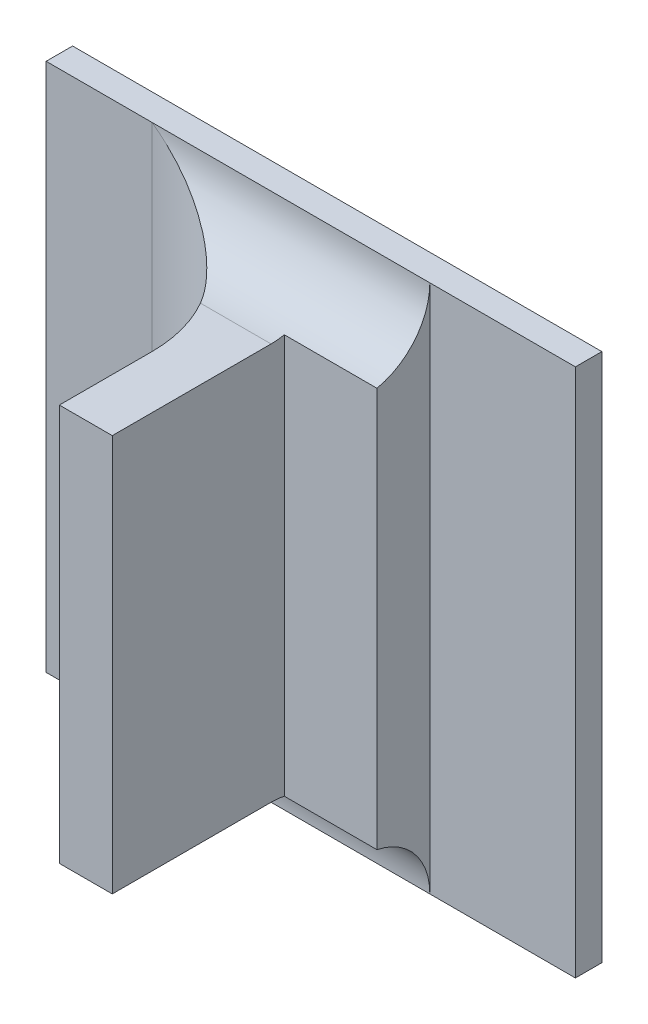
ISO-10303-21;
HEADER;
FILE_DESCRIPTION(('STEP AP214'),'2;1');
FILE_NAME('part.step','',(''),(''),'','','');
FILE_SCHEMA(('AUTOMOTIVE_DESIGN { 1 0 10303 214 1 1 1 1 }'));
ENDSEC;
DATA;
#1=APPLICATION_CONTEXT('core data for automotive mechanical design processes');
#2=APPLICATION_PROTOCOL_DEFINITION('international standard','automotive_design',2000,#1);
#3=PRODUCT_CONTEXT('',#1,'mechanical');
#4=PRODUCT('Part','Part','',(#3));
#5=PRODUCT_RELATED_PRODUCT_CATEGORY('part','',(#4));
#6=PRODUCT_DEFINITION_FORMATION('','',#4);
#7=PRODUCT_DEFINITION_CONTEXT('part definition',#1,'design');
#8=PRODUCT_DEFINITION('design','',#6,#7);
#9=PRODUCT_DEFINITION_SHAPE('','',#8);
#10=(LENGTH_UNIT() NAMED_UNIT(*) SI_UNIT(.MILLI.,.METRE.));
#11=(NAMED_UNIT(*) PLANE_ANGLE_UNIT() SI_UNIT($,.RADIAN.));
#12=(NAMED_UNIT(*) SI_UNIT($,.STERADIAN.) SOLID_ANGLE_UNIT());
#13=UNCERTAINTY_MEASURE_WITH_UNIT(LENGTH_MEASURE(1.E-05),#10,'distance_accuracy_value','');
#14=(GEOMETRIC_REPRESENTATION_CONTEXT(3) GLOBAL_UNCERTAINTY_ASSIGNED_CONTEXT((#13)) GLOBAL_UNIT_ASSIGNED_CONTEXT((#10,
#11,#12)) REPRESENTATION_CONTEXT('',''));
#15=CARTESIAN_POINT('',(0.,0.,0.));
#16=DIRECTION('',(0.,0.,1.));
#17=DIRECTION('',(1.,0.,0.));
#18=AXIS2_PLACEMENT_3D('',#15,#16,#17);
#19=CARTESIAN_POINT('',(0.284904218627624,-0.311549667580545,0.0888870078740156));
#20=DIRECTION('',(0.,0.,1.));
#21=DIRECTION('',(1.,0.,0.));
#22=AXIS2_PLACEMENT_3D('',#19,#20,#21);
#23=PLANE('',#22);
#24=DIRECTION('',(1.,0.,0.));
#25=VECTOR('',#24,1.);
#26=CARTESIAN_POINT('',(0.277588649165875,-0.351234706950624,0.0888870078740156));
#27=LINE('',#26,#25);
#28=CARTESIAN_POINT('',(0.284652250123687,-0.351234706950624,0.0888870078740156));
#29=VERTEX_POINT('',#28);
#30=CARTESIAN_POINT('',(0.279612880044947,-0.351234706950624,0.0888870078740156));
#31=VERTEX_POINT('',#30);
#32=EDGE_CURVE('E193',#29,#31,#27,.F.);
#33=ORIENTED_EDGE('',*,*,#32,.F.);
#34=DIRECTION('',(0.,1.,0.));
#35=VECTOR('',#34,1.);
#36=CARTESIAN_POINT('',(0.284652250123687,-0.35326446766354,0.0888870078740156));
#37=LINE('',#36,#35);
#38=CARTESIAN_POINT('',(0.284652250123687,-0.313439431360073,0.0888870078740156));
#39=VERTEX_POINT('',#38);
#40=EDGE_CURVE('E187',#39,#29,#37,.F.);
#41=ORIENTED_EDGE('',*,*,#40,.F.);
#42=DIRECTION('',(1.,0.,0.));
#43=VECTOR('',#42,1.);
#44=CARTESIAN_POINT('',(0.277588649165875,-0.313439431360073,0.0888870078740156));
#45=LINE('',#44,#43);
#46=CARTESIAN_POINT('',(0.279612880044947,-0.313439431360073,0.0888870078740156));
#47=VERTEX_POINT('',#46);
#48=EDGE_CURVE('E180',#39,#47,#45,.F.);
#49=ORIENTED_EDGE('',*,*,#48,.T.);
#50=DIRECTION('',(0.,-1.,0.));
#51=VECTOR('',#50,1.);
#52=CARTESIAN_POINT('',(0.279612880044947,-0.311549667580545,0.0888870078740156));
#53=LINE('',#52,#51);
#54=EDGE_CURVE('E177',#31,#47,#53,.F.);
#55=ORIENTED_EDGE('',*,*,#54,.F.);
#56=EDGE_LOOP('',(#33,#41,#49,#55));
#57=FACE_BOUND('',#56,.T.);
#58=ADVANCED_FACE('F17',(#57),#23,.T.);
#59=CARTESIAN_POINT('',(0.279612880044947,-0.311549667580545,0.0796271653543306));
#60=DIRECTION('',(-1.,0.,0.));
#61=DIRECTION('',(0.,-1.,0.));
#62=AXIS2_PLACEMENT_3D('',#59,#60,#61);
#63=PLANE('',#62);
#64=DIRECTION('',(0.,0.,1.));
#65=VECTOR('',#64,1.);
#66=CARTESIAN_POINT('',(0.279612880044947,-0.313439431360073,0.0730129921259841));
#67=LINE('',#66,#65);
#68=CARTESIAN_POINT('',(0.279612880044947,-0.313439431360073,0.0800681102362204));
#69=VERTEX_POINT('',#68);
#70=EDGE_CURVE('E184',#47,#69,#67,.F.);
#71=ORIENTED_EDGE('',*,*,#70,.T.);
#72=DIRECTION('',(0.,1.,0.));
#73=VECTOR('',#72,1.);
#74=CARTESIAN_POINT('',(0.279612880044947,-0.360053604588419,0.0800681102362204));
#75=LINE('',#74,#73);
#76=CARTESIAN_POINT('',(0.279612880044947,-0.351234706950624,0.0800681102362204));
#77=VERTEX_POINT('',#76);
#78=EDGE_CURVE('E127',#69,#77,#75,.F.);
#79=ORIENTED_EDGE('',*,*,#78,.T.);
#80=DIRECTION('',(0.,0.,1.));
#81=VECTOR('',#80,1.);
#82=CARTESIAN_POINT('',(0.279612880044947,-0.351234706950624,0.0730129921259841));
#83=LINE('',#82,#81);
#84=EDGE_CURVE('E196',#31,#77,#83,.F.);
#85=ORIENTED_EDGE('',*,*,#84,.F.);
#86=ORIENTED_EDGE('',*,*,#54,.T.);
#87=EDGE_LOOP('',(#71,#79,#85,#86));
#88=FACE_BOUND('',#87,.T.);
#89=ADVANCED_FACE('F242',(#88),#63,.T.);
#90=CARTESIAN_POINT('',(0.277588649165875,-0.313439431360073,0.0730129921259841));
#91=DIRECTION('',(0.,-1.,0.));
#92=DIRECTION('',(1.,0.,0.));
#93=AXIS2_PLACEMENT_3D('',#90,#91,#92);
#94=PLANE('',#93);
#95=ORIENTED_EDGE('',*,*,#70,.F.);
#96=ORIENTED_EDGE('',*,*,#48,.F.);
#97=DIRECTION('',(0.,0.,1.));
#98=VECTOR('',#97,1.);
#99=CARTESIAN_POINT('',(0.284652250123687,-0.313439431360073,0.0716901574803148));
#100=LINE('',#99,#98);
#101=CARTESIAN_POINT('',(0.284652250123687,-0.313439431360073,0.0737688976377952));
#102=VERTEX_POINT('',#101);
#103=EDGE_CURVE('E115',#102,#39,#100,.T.);
#104=ORIENTED_EDGE('',*,*,#103,.F.);
#105=DIRECTION('',(1.,0.,0.));
#106=VECTOR('',#105,1.);
#107=CARTESIAN_POINT('',(0.265691620202427,-0.313439431360073,0.0737688976377952));
#108=LINE('',#107,#106);
#109=CARTESIAN_POINT('',(0.277925011116247,-0.313439431360073,0.0737688976377952));
#110=VERTEX_POINT('',#109);
#111=EDGE_CURVE('E109',#102,#110,#108,.F.);
#112=ORIENTED_EDGE('',*,*,#111,.T.);
#113=CARTESIAN_POINT('',(0.267014454848097,-0.313439431360073,0.0800681102362204));
#114=DIRECTION('',(0.,1.,0.));
#115=DIRECTION('',(-1.,0.,0.));
#116=AXIS2_PLACEMENT_3D('',#113,#114,#115);
#117=CIRCLE('',#116,0.0125984251968504);
#118=EDGE_CURVE('E20',#110,#69,#117,.F.);
#119=ORIENTED_EDGE('',*,*,#118,.T.);
#120=EDGE_LOOP('',(#95,#96,#104,#112,#119));
#121=FACE_BOUND('',#120,.T.);
#122=ADVANCED_FACE('F112',(#121),#94,.F.);
#123=CARTESIAN_POINT('',(0.277588649165875,-0.351234706950624,0.0730129921259841));
#124=DIRECTION('',(0.,-1.,0.));
#125=DIRECTION('',(1.,0.,0.));
#126=AXIS2_PLACEMENT_3D('',#123,#124,#125);
#127=PLANE('',#126);
#128=CARTESIAN_POINT('',(0.267014454848097,-0.351234706950624,0.0800681102362204));
#129=DIRECTION('',(0.,1.,0.));
#130=DIRECTION('',(-1.,0.,0.));
#131=AXIS2_PLACEMENT_3D('',#128,#129,#130);
#132=CIRCLE('',#131,0.0125984251968504);
#133=CARTESIAN_POINT('',(0.277925011116247,-0.351234706950624,0.0737688976377951));
#134=VERTEX_POINT('',#133);
#135=EDGE_CURVE('E121',#77,#134,#132,.T.);
#136=ORIENTED_EDGE('',*,*,#135,.T.);
#137=DIRECTION('',(-1.,0.,0.));
#138=VECTOR('',#137,1.);
#139=CARTESIAN_POINT('',(0.319927840674868,-0.351234706950624,0.0737688976377952));
#140=LINE('',#139,#138);
#141=CARTESIAN_POINT('',(0.284652250123687,-0.351234706950624,0.0737688976377952));
#142=VERTEX_POINT('',#141);
#143=EDGE_CURVE('E169',#134,#142,#140,.F.);
#144=ORIENTED_EDGE('',*,*,#143,.T.);
#145=DIRECTION('',(0.,0.,1.));
#146=VECTOR('',#145,1.);
#147=CARTESIAN_POINT('',(0.284652250123687,-0.351234706950624,0.0716901574803148));
#148=LINE('',#147,#146);
#149=EDGE_CURVE('E190',#29,#142,#148,.F.);
#150=ORIENTED_EDGE('',*,*,#149,.F.);
#151=ORIENTED_EDGE('',*,*,#32,.T.);
#152=ORIENTED_EDGE('',*,*,#84,.T.);
#153=EDGE_LOOP('',(#136,#144,#150,#151,#152));
#154=FACE_BOUND('',#153,.T.);
#155=ADVANCED_FACE('F235',(#154),#127,.T.);
#156=CARTESIAN_POINT('',(0.284652250123687,-0.35326446766354,0.0716901574803148));
#157=DIRECTION('',(1.,0.,0.));
#158=DIRECTION('',(0.,1.,0.));
#159=AXIS2_PLACEMENT_3D('',#156,#157,#158);
#160=PLANE('',#159);
#161=DIRECTION('',(0.,1.,0.));
#162=VECTOR('',#161,1.);
#163=CARTESIAN_POINT('',(0.284652250123687,-0.311409670647157,0.0725090551181101));
#164=LINE('',#163,#162);
#165=CARTESIAN_POINT('',(0.284652250123687,-0.313312161420629,0.0725090551181101));
#166=VERTEX_POINT('',#165);
#167=CARTESIAN_POINT('',(0.284652250123687,-0.351361976890068,0.0725090551181101));
#168=VERTEX_POINT('',#167);
#169=EDGE_CURVE('E216',#166,#168,#164,.F.);
#170=ORIENTED_EDGE('',*,*,#169,.F.);
#171=CARTESIAN_POINT('',(0.284652250123687,-0.313312161420629,0.0725090551181101));
#172=CARTESIAN_POINT('',(0.284652250123687,-0.313439431360073,0.0731325479405746));
#173=CARTESIAN_POINT('',(0.284652250123687,-0.313439431360073,0.0737688976377952));
#174=B_SPLINE_CURVE_WITH_KNOTS('',2,(#171,#172,#173),.UNSPECIFIED.,.F.,.F.,(3,3),(0.,1.),.UNSPECIFIED.);
#175=EDGE_CURVE('E217',#166,#102,#174,.T.);
#176=ORIENTED_EDGE('',*,*,#175,.T.);
#177=ORIENTED_EDGE('',*,*,#103,.T.);
#178=ORIENTED_EDGE('',*,*,#40,.T.);
#179=ORIENTED_EDGE('',*,*,#149,.T.);
#180=CARTESIAN_POINT('',(0.284652250123687,-0.351234706950624,0.0737688976377952));
#181=CARTESIAN_POINT('',(0.284652250123687,-0.351234706950624,0.0731325479405747));
#182=CARTESIAN_POINT('',(0.284652250123687,-0.351361976890068,0.0725090551181101));
#183=B_SPLINE_CURVE_WITH_KNOTS('',2,(#180,#181,#182),.UNSPECIFIED.,.F.,.F.,(3,3),(0.,1.),.UNSPECIFIED.);
#184=EDGE_CURVE('E221',#142,#168,#183,.T.);
#185=ORIENTED_EDGE('',*,*,#184,.T.);
#186=EDGE_LOOP('',(#170,#176,#177,#178,#179,#185));
#187=FACE_BOUND('',#186,.T.);
#188=ADVANCED_FACE('F224',(#187),#160,.T.);
#189=CARTESIAN_POINT('',(0.293912092643372,-0.311409670647157,0.0725090551181101));
#190=DIRECTION('',(0.,0.,1.));
#191=DIRECTION('',(1.,0.,0.));
#192=AXIS2_PLACEMENT_3D('',#189,#190,#191);
#193=PLANE('',#192);
#194=DIRECTION('',(0.,1.,0.));
#195=VECTOR('',#194,1.);
#196=CARTESIAN_POINT('',(0.293471147761482,-0.304620533722278,0.0725090551181101));
#197=LINE('',#196,#195);
#198=CARTESIAN_POINT('',(0.293471147761482,-0.313312161420629,0.0725090551181101));
#199=VERTEX_POINT('',#198);
#200=CARTESIAN_POINT('',(0.293471147761482,-0.351361976890068,0.0725090551181101));
#201=VERTEX_POINT('',#200);
#202=EDGE_CURVE('E128',#199,#201,#197,.F.);
#203=ORIENTED_EDGE('',*,*,#202,.F.);
#204=DIRECTION('',(1.,0.,0.));
#205=VECTOR('',#204,1.);
#206=CARTESIAN_POINT('',(0.265691620202427,-0.313312161420629,0.0725090551181101));
#207=LINE('',#206,#205);
#208=EDGE_CURVE('E139',#199,#166,#207,.F.);
#209=ORIENTED_EDGE('',*,*,#208,.T.);
#210=ORIENTED_EDGE('',*,*,#169,.T.);
#211=DIRECTION('',(-1.,0.,0.));
#212=VECTOR('',#211,1.);
#213=CARTESIAN_POINT('',(0.319927840674868,-0.351361976890068,0.0725090551181101));
#214=LINE('',#213,#212);
#215=EDGE_CURVE('E174',#168,#201,#214,.F.);
#216=ORIENTED_EDGE('',*,*,#215,.T.);
#217=EDGE_LOOP('',(#203,#209,#210,#216));
#218=FACE_BOUND('',#217,.T.);
#219=ADVANCED_FACE('F234',(#218),#193,.T.);
#220=CARTESIAN_POINT('',(0.293471147761482,-0.304620533722278,0.067217716535433));
#221=DIRECTION('',(1.,0.,0.));
#222=DIRECTION('',(0.,1.,0.));
#223=AXIS2_PLACEMENT_3D('',#220,#221,#222);
#224=PLANE('',#223);
#225=DIRECTION('',(0.,1.,0.));
#226=VECTOR('',#225,1.);
#227=CARTESIAN_POINT('',(0.293471147761482,-0.304620533722278,0.06746968503937));
#228=LINE('',#227,#226);
#229=CARTESIAN_POINT('',(0.293471147761482,-0.357533919549049,0.06746968503937));
#230=VERTEX_POINT('',#229);
#231=CARTESIAN_POINT('',(0.293471147761482,-0.307140218761648,0.06746968503937));
#232=VERTEX_POINT('',#231);
#233=EDGE_CURVE('E170',#230,#232,#228,.T.);
#234=ORIENTED_EDGE('',*,*,#233,.T.);
#235=CARTESIAN_POINT('',(0.293471147761482,-0.307140218761648,0.0737688976377952));
#236=DIRECTION('',(1.,0.,0.));
#237=DIRECTION('',(0.,1.,0.));
#238=AXIS2_PLACEMENT_3D('',#235,#236,#237);
#239=CIRCLE('',#238,0.0062992125984252);
#240=EDGE_CURVE('E136',#232,#199,#239,.F.);
#241=ORIENTED_EDGE('',*,*,#240,.T.);
#242=ORIENTED_EDGE('',*,*,#202,.T.);
#243=CARTESIAN_POINT('',(0.293471147761482,-0.357533919549049,0.0737688976377952));
#244=DIRECTION('',(-1.,0.,0.));
#245=DIRECTION('',(0.,-1.,0.));
#246=AXIS2_PLACEMENT_3D('',#243,#244,#245);
#247=CIRCLE('',#246,0.0062992125984252);
#248=EDGE_CURVE('E171',#201,#230,#247,.T.);
#249=ORIENTED_EDGE('',*,*,#248,.T.);
#250=EDGE_LOOP('',(#234,#241,#242,#249));
#251=FACE_BOUND('',#250,.T.);
#252=ADVANCED_FACE('F318',(#251),#224,.T.);
#253=CARTESIAN_POINT('',(0.267014454848097,-0.360053604588419,0.0800681102362204));
#254=DIRECTION('',(0.,1.,0.));
#255=DIRECTION('',(-1.,0.,0.));
#256=AXIS2_PLACEMENT_3D('',#253,#254,#255);
#257=CYLINDRICAL_SURFACE('',#256,0.0125984251968504);
#258=ORIENTED_EDGE('',*,*,#78,.F.);
#259=ORIENTED_EDGE('',*,*,#118,.F.);
#260=CARTESIAN_POINT('',(0.277925011116247,-0.313439431360073,0.073768897637795));
#261=CARTESIAN_POINT('',(0.277652526611768,-0.313438873707853,0.0732955457546591));
#262=CARTESIAN_POINT('',(0.277350414486164,-0.313386346377414,0.0728445682080297));
#263=CARTESIAN_POINT('',(0.276704946712164,-0.313201363699116,0.0720003898002664));
#264=CARTESIAN_POINT('',(0.276362214236907,-0.313070015578846,0.0716064807283955));
#265=CARTESIAN_POINT('',(0.275576977112133,-0.312719656172453,0.0708064921171964));
#266=CARTESIAN_POINT('',(0.27512790598383,-0.312488708936628,0.0704123993317733));
#267=CARTESIAN_POINT('',(0.274197979722231,-0.311970610304802,0.0697017381084181));
#268=CARTESIAN_POINT('',(0.273716946451535,-0.311683122697778,0.0693856602556568));
#269=CARTESIAN_POINT('',(0.272536209007032,-0.310946965938325,0.0687164538298326));
#270=CARTESIAN_POINT('',(0.27182693189567,-0.310480210038906,0.0684002761150404));
#271=CARTESIAN_POINT('',(0.270389904180813,-0.309508649017801,0.0679065689436589));
#272=CARTESIAN_POINT('',(0.269662185421036,-0.309003906866,0.0677288153407497));
#273=CARTESIAN_POINT('',(0.268486222851557,-0.308179722442743,0.0675478835698786));
#274=CARTESIAN_POINT('',(0.268040368067287,-0.307865289365079,0.0675035718032502));
#275=CARTESIAN_POINT('',(0.267400947022718,-0.307413510055304,0.0674741343290926));
#276=CARTESIAN_POINT('',(0.267207696373057,-0.307276860634179,0.0674696949622004));
#277=CARTESIAN_POINT('',(0.267014454848097,-0.307140218761648,0.06746968503937));
#278=B_SPLINE_CURVE_WITH_KNOTS('',3,(#260,#261,#262,#263,#264,#265,#266,#267,#268,#269,#270,
#271,#272,#273,#274,#275,#276,#277),.UNSPECIFIED.,.F.,.F.,(4,2,2,2,2,2,2,2,4),(0.,
0.00162828046163536,0.00323420635682064,0.00514617952943934,0.00706988591555804,
0.00977367423346223,0.012473075225337,0.0141132082090727,0.0148232188039429),.UNSPECIFIED.);
#279=CARTESIAN_POINT('',(0.267014454848097,-0.307140218761648,0.06746968503937));
#280=VERTEX_POINT('',#279);
#281=EDGE_CURVE('E120',#110,#280,#278,.T.);
#282=ORIENTED_EDGE('',*,*,#281,.T.);
#283=DIRECTION('',(0.,1.,0.));
#284=VECTOR('',#283,1.);
#285=CARTESIAN_POINT('',(0.267014454848097,-0.304620533722278,0.06746968503937));
#286=LINE('',#285,#284);
#287=CARTESIAN_POINT('',(0.267014454848097,-0.357533919549049,0.06746968503937));
#288=VERTEX_POINT('',#287);
#289=EDGE_CURVE('E173',#280,#288,#286,.F.);
#290=ORIENTED_EDGE('',*,*,#289,.T.);
#291=CARTESIAN_POINT('',(0.277925011116247,-0.351234706950624,0.073768897637795));
#292=CARTESIAN_POINT('',(0.277652526611768,-0.351235264602844,0.0732955457546591));
#293=CARTESIAN_POINT('',(0.277350414486164,-0.351287791933283,0.0728445682080297));
#294=CARTESIAN_POINT('',(0.276704946712164,-0.351472774611581,0.0720003898002663));
#295=CARTESIAN_POINT('',(0.276362214236907,-0.351604122731851,0.0716064807283955));
#296=CARTESIAN_POINT('',(0.275576977112133,-0.351954482138244,0.0708064921171964));
#297=CARTESIAN_POINT('',(0.27512790598383,-0.352185429374069,0.0704123993317733));
#298=CARTESIAN_POINT('',(0.274197979722231,-0.352703528005895,0.0697017381084181));
#299=CARTESIAN_POINT('',(0.273716946451535,-0.352991015612919,0.0693856602556568));
#300=CARTESIAN_POINT('',(0.272536209007032,-0.353727172372372,0.0687164538298326));
#301=CARTESIAN_POINT('',(0.27182693189567,-0.354193928271791,0.0684002761150404));
#302=CARTESIAN_POINT('',(0.270389904180813,-0.355165489292896,0.0679065689436589));
#303=CARTESIAN_POINT('',(0.269662185421036,-0.355670231444697,0.0677288153407497));
#304=CARTESIAN_POINT('',(0.268486222851557,-0.356494415867953,0.0675478835698786));
#305=CARTESIAN_POINT('',(0.268040368067287,-0.356808848945618,0.0675035718032502));
#306=CARTESIAN_POINT('',(0.267400947022718,-0.357260628255393,0.0674741343290926));
#307=CARTESIAN_POINT('',(0.267207696373057,-0.357397277676518,0.0674696949622004));
#308=CARTESIAN_POINT('',(0.267014454848097,-0.357533919549049,0.06746968503937));
#309=B_SPLINE_CURVE_WITH_KNOTS('',3,(#291,#292,#293,#294,#295,#296,#297,#298,#299,#300,#301,
#302,#303,#304,#305,#306,#307,#308),.UNSPECIFIED.,.F.,.F.,(4,2,2,2,2,2,2,2,4),(0.,
0.00162828046163538,0.00323420635682063,0.00514617952943933,0.00706988591555799,
0.00977367423346224,0.012473075225337,0.0141132082090727,0.0148232188039429),.UNSPECIFIED.);
#310=EDGE_CURVE('E163',#288,#134,#309,.F.);
#311=ORIENTED_EDGE('',*,*,#310,.T.);
#312=ORIENTED_EDGE('',*,*,#135,.F.);
#313=EDGE_LOOP('',(#258,#259,#282,#290,#311,#312));
#314=FACE_BOUND('',#313,.T.);
#315=ADVANCED_FACE('F124',(#314),#257,.F.);
#316=CARTESIAN_POINT('',(0.265691620202427,-0.307140218761648,0.0737688976377952));
#317=DIRECTION('',(1.,0.,0.));
#318=DIRECTION('',(0.,1.,0.));
#319=AXIS2_PLACEMENT_3D('',#316,#317,#318);
#320=CYLINDRICAL_SURFACE('',#319,0.0062992125984252);
#321=ORIENTED_EDGE('',*,*,#208,.F.);
#322=ORIENTED_EDGE('',*,*,#240,.F.);
#323=DIRECTION('',(-1.,0.,0.));
#324=VECTOR('',#323,1.);
#325=CARTESIAN_POINT('',(0.309849100517388,-0.307140218761648,0.06746968503937));
#326=LINE('',#325,#324);
#327=EDGE_CURVE('E134',#280,#232,#326,.F.);
#328=ORIENTED_EDGE('',*,*,#327,.F.);
#329=ORIENTED_EDGE('',*,*,#281,.F.);
#330=ORIENTED_EDGE('',*,*,#111,.F.);
#331=ORIENTED_EDGE('',*,*,#175,.F.);
#332=EDGE_LOOP('',(#321,#322,#328,#329,#330,#331));
#333=FACE_BOUND('',#332,.T.);
#334=ADVANCED_FACE('F131',(#333),#320,.F.);
#335=CARTESIAN_POINT('',(0.292778234375655,-0.304620533722278,0.06746968503937));
#336=DIRECTION('',(0.,0.,-1.));
#337=DIRECTION('',(-1.,0.,0.));
#338=AXIS2_PLACEMENT_3D('',#335,#336,#337);
#339=PLANE('',#338);
#340=DIRECTION('',(0.,1.,0.));
#341=VECTOR('',#340,1.);
#342=CARTESIAN_POINT('',(0.307329415478018,-0.36005360458842,0.06746968503937));
#343=LINE('',#342,#341);
#344=CARTESIAN_POINT('',(0.307329415478018,-0.307140218761648,0.06746968503937));
#345=VERTEX_POINT('',#344);
#346=CARTESIAN_POINT('',(0.307329415478018,-0.357533919549049,0.06746968503937));
#347=VERTEX_POINT('',#346);
#348=EDGE_CURVE('E281',#345,#347,#343,.F.);
#349=ORIENTED_EDGE('',*,*,#348,.F.);
#350=DIRECTION('',(-1.,0.,0.));
#351=VECTOR('',#350,1.);
#352=CARTESIAN_POINT('',(0.309849100517388,-0.307140218761648,0.06746968503937));
#353=LINE('',#352,#351);
#354=EDGE_CURVE('E206',#232,#345,#353,.F.);
#355=ORIENTED_EDGE('',*,*,#354,.F.);
#356=ORIENTED_EDGE('',*,*,#233,.F.);
#357=DIRECTION('',(1.,0.,0.));
#358=VECTOR('',#357,1.);
#359=CARTESIAN_POINT('',(0.254416029651246,-0.357533919549049,0.06746968503937));
#360=LINE('',#359,#358);
#361=EDGE_CURVE('E283',#347,#230,#360,.F.);
#362=ORIENTED_EDGE('',*,*,#361,.F.);
#363=EDGE_LOOP('',(#349,#355,#356,#362));
#364=FACE_BOUND('',#363,.T.);
#365=ADVANCED_FACE('F152',(#364),#339,.F.);
#366=CARTESIAN_POINT('',(0.319927840674868,-0.357533919549049,0.0737688976377952));
#367=DIRECTION('',(-1.,0.,0.));
#368=DIRECTION('',(0.,-1.,0.));
#369=AXIS2_PLACEMENT_3D('',#366,#367,#368);
#370=CYLINDRICAL_SURFACE('',#369,0.0062992125984252);
#371=ORIENTED_EDGE('',*,*,#215,.F.);
#372=ORIENTED_EDGE('',*,*,#184,.F.);
#373=ORIENTED_EDGE('',*,*,#143,.F.);
#374=ORIENTED_EDGE('',*,*,#310,.F.);
#375=DIRECTION('',(1.,0.,0.));
#376=VECTOR('',#375,1.);
#377=CARTESIAN_POINT('',(0.254416029651246,-0.357533919549049,0.06746968503937));
#378=LINE('',#377,#376);
#379=EDGE_CURVE('E303',#230,#288,#378,.F.);
#380=ORIENTED_EDGE('',*,*,#379,.F.);
#381=ORIENTED_EDGE('',*,*,#248,.F.);
#382=EDGE_LOOP('',(#371,#372,#373,#374,#380,#381));
#383=FACE_BOUND('',#382,.T.);
#384=ADVANCED_FACE('F155',(#383),#370,.F.);
#385=CARTESIAN_POINT('',(0.256431777682742,-0.304620533722278,0.06746968503937));
#386=DIRECTION('',(0.,0.,-1.));
#387=DIRECTION('',(-1.,0.,0.));
#388=AXIS2_PLACEMENT_3D('',#385,#386,#387);
#389=PLANE('',#388);
#390=DIRECTION('',(-1.,0.,0.));
#391=VECTOR('',#390,1.);
#392=CARTESIAN_POINT('',(0.309849100517388,-0.307140218761648,0.06746968503937));
#393=LINE('',#392,#391);
#394=CARTESIAN_POINT('',(0.256935714690616,-0.307140218761648,0.06746968503937));
#395=VERTEX_POINT('',#394);
#396=EDGE_CURVE('E298',#395,#280,#393,.F.);
#397=ORIENTED_EDGE('',*,*,#396,.F.);
#398=DIRECTION('',(0.,-1.,0.));
#399=VECTOR('',#398,1.);
#400=CARTESIAN_POINT('',(0.256935714690616,-0.304620533722278,0.06746968503937));
#401=LINE('',#400,#399);
#402=CARTESIAN_POINT('',(0.256935714690616,-0.357533919549049,0.06746968503937));
#403=VERTEX_POINT('',#402);
#404=EDGE_CURVE('E325',#403,#395,#401,.F.);
#405=ORIENTED_EDGE('',*,*,#404,.F.);
#406=DIRECTION('',(1.,0.,0.));
#407=VECTOR('',#406,1.);
#408=CARTESIAN_POINT('',(0.254416029651246,-0.357533919549049,0.06746968503937));
#409=LINE('',#408,#407);
#410=EDGE_CURVE('E301',#288,#403,#409,.F.);
#411=ORIENTED_EDGE('',*,*,#410,.F.);
#412=ORIENTED_EDGE('',*,*,#289,.F.);
#413=EDGE_LOOP('',(#397,#405,#411,#412));
#414=FACE_BOUND('',#413,.T.);
#415=ADVANCED_FACE('F160',(#414),#389,.F.);
#416=CARTESIAN_POINT('',(0.309849100517388,-0.307140218761648,0.0648240157480314));
#417=DIRECTION('',(0.,1.,0.));
#418=DIRECTION('',(-1.,0.,0.));
#419=AXIS2_PLACEMENT_3D('',#416,#417,#418);
#420=PLANE('',#419);
#421=ORIENTED_EDGE('',*,*,#354,.T.);
#422=DIRECTION('',(0.,0.,1.));
#423=VECTOR('',#422,1.);
#424=CARTESIAN_POINT('',(0.307329415478018,-0.307140218761648,0.0648240157480314));
#425=LINE('',#424,#423);
#426=CARTESIAN_POINT('',(0.307329415478018,-0.307140218761648,0.0649499999999999));
#427=VERTEX_POINT('',#426);
#428=EDGE_CURVE('E208',#427,#345,#425,.T.);
#429=ORIENTED_EDGE('',*,*,#428,.F.);
#430=DIRECTION('',(-1.,0.,0.));
#431=VECTOR('',#430,1.);
#432=CARTESIAN_POINT('',(0.254416029651246,-0.307140218761648,0.0649499999999999));
#433=LINE('',#432,#431);
#434=CARTESIAN_POINT('',(0.256935714690616,-0.307140218761648,0.0649499999999999));
#435=VERTEX_POINT('',#434);
#436=EDGE_CURVE('E332',#435,#427,#433,.F.);
#437=ORIENTED_EDGE('',*,*,#436,.F.);
#438=DIRECTION('',(0.,0.,1.));
#439=VECTOR('',#438,1.);
#440=CARTESIAN_POINT('',(0.256935714690616,-0.307140218761648,0.0648240157480314));
#441=LINE('',#440,#439);
#442=EDGE_CURVE('E329',#395,#435,#441,.F.);
#443=ORIENTED_EDGE('',*,*,#442,.F.);
#444=ORIENTED_EDGE('',*,*,#396,.T.);
#445=ORIENTED_EDGE('',*,*,#327,.T.);
#446=EDGE_LOOP('',(#421,#429,#437,#443,#444,#445));
#447=FACE_BOUND('',#446,.T.);
#448=ADVANCED_FACE('F267',(#447),#420,.T.);
#449=CARTESIAN_POINT('',(0.307329415478018,-0.36005360458842,0.0648240157480314));
#450=DIRECTION('',(1.,0.,0.));
#451=DIRECTION('',(0.,1.,0.));
#452=AXIS2_PLACEMENT_3D('',#449,#450,#451);
#453=PLANE('',#452);
#454=ORIENTED_EDGE('',*,*,#348,.T.);
#455=DIRECTION('',(0.,0.,1.));
#456=VECTOR('',#455,1.);
#457=CARTESIAN_POINT('',(0.307329415478018,-0.357533919549049,0.0648240157480314));
#458=LINE('',#457,#456);
#459=CARTESIAN_POINT('',(0.307329415478018,-0.357533919549049,0.0649499999999999));
#460=VERTEX_POINT('',#459);
#461=EDGE_CURVE('E285',#460,#347,#458,.T.);
#462=ORIENTED_EDGE('',*,*,#461,.F.);
#463=DIRECTION('',(0.,1.,0.));
#464=VECTOR('',#463,1.);
#465=CARTESIAN_POINT('',(0.307329415478018,-0.304620533722278,0.0649499999999999));
#466=LINE('',#465,#464);
#467=EDGE_CURVE('E288',#427,#460,#466,.F.);
#468=ORIENTED_EDGE('',*,*,#467,.F.);
#469=ORIENTED_EDGE('',*,*,#428,.T.);
#470=EDGE_LOOP('',(#454,#462,#468,#469));
#471=FACE_BOUND('',#470,.T.);
#472=ADVANCED_FACE('F265',(#471),#453,.T.);
#473=CARTESIAN_POINT('',(0.254416029651246,-0.357533919549049,0.0648240157480314));
#474=DIRECTION('',(0.,-1.,0.));
#475=DIRECTION('',(1.,0.,0.));
#476=AXIS2_PLACEMENT_3D('',#473,#474,#475);
#477=PLANE('',#476);
#478=ORIENTED_EDGE('',*,*,#410,.T.);
#479=DIRECTION('',(0.,0.,1.));
#480=VECTOR('',#479,1.);
#481=CARTESIAN_POINT('',(0.256935714690616,-0.357533919549049,0.0648240157480314));
#482=LINE('',#481,#480);
#483=CARTESIAN_POINT('',(0.256935714690616,-0.357533919549049,0.0649499999999999));
#484=VERTEX_POINT('',#483);
#485=EDGE_CURVE('E35',#484,#403,#482,.T.);
#486=ORIENTED_EDGE('',*,*,#485,.F.);
#487=DIRECTION('',(-1.,0.,0.));
#488=VECTOR('',#487,1.);
#489=CARTESIAN_POINT('',(0.254416029651246,-0.357533919549049,0.0649499999999999));
#490=LINE('',#489,#488);
#491=EDGE_CURVE('E26',#460,#484,#490,.T.);
#492=ORIENTED_EDGE('',*,*,#491,.F.);
#493=ORIENTED_EDGE('',*,*,#461,.T.);
#494=ORIENTED_EDGE('',*,*,#361,.T.);
#495=ORIENTED_EDGE('',*,*,#379,.T.);
#496=EDGE_LOOP('',(#478,#486,#492,#493,#494,#495));
#497=FACE_BOUND('',#496,.T.);
#498=ADVANCED_FACE('F258',(#497),#477,.T.);
#499=CARTESIAN_POINT('',(0.256935714690616,-0.304620533722278,0.0648240157480314));
#500=DIRECTION('',(-1.,0.,0.));
#501=DIRECTION('',(0.,-1.,0.));
#502=AXIS2_PLACEMENT_3D('',#499,#500,#501);
#503=PLANE('',#502);
#504=ORIENTED_EDGE('',*,*,#404,.T.);
#505=ORIENTED_EDGE('',*,*,#442,.T.);
#506=DIRECTION('',(0.,1.,0.));
#507=VECTOR('',#506,1.);
#508=CARTESIAN_POINT('',(0.256935714690616,-0.304620533722278,0.0649499999999999));
#509=LINE('',#508,#507);
#510=EDGE_CURVE('E11',#484,#435,#509,.T.);
#511=ORIENTED_EDGE('',*,*,#510,.F.);
#512=ORIENTED_EDGE('',*,*,#485,.T.);
#513=EDGE_LOOP('',(#504,#505,#511,#512));
#514=FACE_BOUND('',#513,.T.);
#515=ADVANCED_FACE('F252',(#514),#503,.T.);
#516=CARTESIAN_POINT('',(0.254416029651246,-0.304620533722278,0.0649499999999999));
#517=DIRECTION('',(0.,0.,-1.));
#518=DIRECTION('',(-1.,0.,0.));
#519=AXIS2_PLACEMENT_3D('',#516,#517,#518);
#520=PLANE('',#519);
#521=ORIENTED_EDGE('',*,*,#491,.T.);
#522=ORIENTED_EDGE('',*,*,#510,.T.);
#523=ORIENTED_EDGE('',*,*,#436,.T.);
#524=ORIENTED_EDGE('',*,*,#467,.T.);
#525=EDGE_LOOP('',(#521,#522,#523,#524));
#526=FACE_BOUND('',#525,.T.);
#527=ADVANCED_FACE('F250',(#526),#520,.T.);
#528=CLOSED_SHELL('',(#58,#89,#122,#155,#188,#219,#252,#315,#334,#365,#384,#415,#448,#472,#498,
#515,#527));
#529=MANIFOLD_SOLID_BREP('B1',#528);
#530=ADVANCED_BREP_SHAPE_REPRESENTATION('',(#18,#529),#14);
#531=SHAPE_DEFINITION_REPRESENTATION(#9,#530);
ENDSEC;
END-ISO-10303-21;
